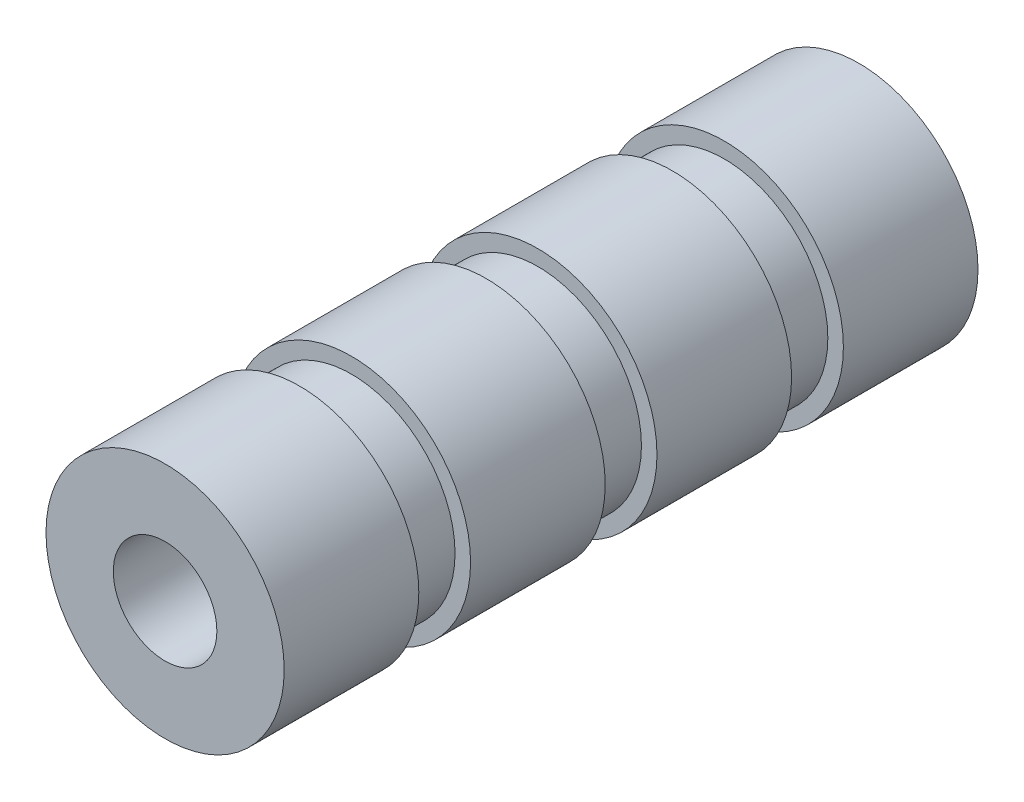
ISO-10303-21;
HEADER;
FILE_DESCRIPTION(('STEP AP214'),'2;1');
FILE_NAME('part.step','',(''),(''),'','','');
FILE_SCHEMA(('AUTOMOTIVE_DESIGN { 1 0 10303 214 1 1 1 1 }'));
ENDSEC;
DATA;
#1=APPLICATION_CONTEXT('core data for automotive mechanical design processes');
#2=APPLICATION_PROTOCOL_DEFINITION('international standard','automotive_design',2000,#1);
#3=PRODUCT_CONTEXT('',#1,'mechanical');
#4=PRODUCT('Part','Part','',(#3));
#5=PRODUCT_RELATED_PRODUCT_CATEGORY('part','',(#4));
#6=PRODUCT_DEFINITION_FORMATION('','',#4);
#7=PRODUCT_DEFINITION_CONTEXT('part definition',#1,'design');
#8=PRODUCT_DEFINITION('design','',#6,#7);
#9=PRODUCT_DEFINITION_SHAPE('','',#8);
#10=(LENGTH_UNIT() NAMED_UNIT(*) SI_UNIT(.MILLI.,.METRE.));
#11=(NAMED_UNIT(*) PLANE_ANGLE_UNIT() SI_UNIT($,.RADIAN.));
#12=(NAMED_UNIT(*) SI_UNIT($,.STERADIAN.) SOLID_ANGLE_UNIT());
#13=UNCERTAINTY_MEASURE_WITH_UNIT(LENGTH_MEASURE(1.E-05),#10,'distance_accuracy_value','');
#14=(GEOMETRIC_REPRESENTATION_CONTEXT(3) GLOBAL_UNCERTAINTY_ASSIGNED_CONTEXT((#13)) GLOBAL_UNIT_ASSIGNED_CONTEXT((#10,
#11,#12)) REPRESENTATION_CONTEXT('',''));
#15=CARTESIAN_POINT('',(0.,0.,0.));
#16=DIRECTION('',(0.,0.,1.));
#17=DIRECTION('',(1.,0.,0.));
#18=AXIS2_PLACEMENT_3D('',#15,#16,#17);
#19=CARTESIAN_POINT('',(0.,0.,13.));
#20=DIRECTION('',(0.,0.,-1.));
#21=DIRECTION('',(-1.,0.,0.));
#22=AXIS2_PLACEMENT_3D('',#19,#20,#21);
#23=CYLINDRICAL_SURFACE('',#22,11.5);
#24=CARTESIAN_POINT('',(0.,0.,13.));
#25=DIRECTION('',(0.,0.,1.));
#26=DIRECTION('',(1.,0.,0.));
#27=AXIS2_PLACEMENT_3D('',#24,#25,#26);
#28=CIRCLE('',#27,11.5);
#29=CARTESIAN_POINT('',(11.5,0.,13.));
#30=VERTEX_POINT('',#29);
#31=EDGE_CURVE('E89',#30,#30,#28,.T.);
#32=ORIENTED_EDGE('',*,*,#31,.F.);
#33=EDGE_LOOP('',(#32));
#34=FACE_BOUND('',#33,.T.);
#35=CARTESIAN_POINT('',(0.,0.,0.));
#36=DIRECTION('',(0.,0.,1.));
#37=DIRECTION('',(1.,0.,0.));
#38=AXIS2_PLACEMENT_3D('',#35,#36,#37);
#39=CIRCLE('',#38,11.5);
#40=CARTESIAN_POINT('',(11.5,0.,0.));
#41=VERTEX_POINT('',#40);
#42=EDGE_CURVE('E46',#41,#41,#39,.T.);
#43=ORIENTED_EDGE('',*,*,#42,.T.);
#44=EDGE_LOOP('',(#43));
#45=FACE_BOUND('',#44,.T.);
#46=ADVANCED_FACE('F43',(#34,#45),#23,.T.);
#47=CARTESIAN_POINT('',(0.,0.,13.));
#48=DIRECTION('',(0.,0.,1.));
#49=DIRECTION('',(1.,0.,0.));
#50=AXIS2_PLACEMENT_3D('',#47,#48,#49);
#51=PLANE('',#50);
#52=CARTESIAN_POINT('',(0.,0.,13.));
#53=DIRECTION('',(0.,0.,1.));
#54=DIRECTION('',(1.,0.,0.));
#55=AXIS2_PLACEMENT_3D('',#52,#53,#54);
#56=CIRCLE('',#55,10.);
#57=CARTESIAN_POINT('',(10.,0.,13.));
#58=VERTEX_POINT('',#57);
#59=EDGE_CURVE('E57',#58,#58,#56,.T.);
#60=ORIENTED_EDGE('',*,*,#59,.F.);
#61=EDGE_LOOP('',(#60));
#62=FACE_BOUND('',#61,.T.);
#63=ORIENTED_EDGE('',*,*,#31,.T.);
#64=EDGE_LOOP('',(#63));
#65=FACE_BOUND('',#64,.T.);
#66=ADVANCED_FACE('F102',(#62,#65),#51,.T.);
#67=CARTESIAN_POINT('',(0.,0.,0.));
#68=DIRECTION('',(0.,0.,1.));
#69=DIRECTION('',(1.,0.,0.));
#70=AXIS2_PLACEMENT_3D('',#67,#68,#69);
#71=PLANE('',#70);
#72=CARTESIAN_POINT('',(0.,0.,0.));
#73=DIRECTION('',(0.,0.,1.));
#74=DIRECTION('',(1.,0.,0.));
#75=AXIS2_PLACEMENT_3D('',#72,#73,#74);
#76=CIRCLE('',#75,5.);
#77=CARTESIAN_POINT('',(5.,0.,0.));
#78=VERTEX_POINT('',#77);
#79=EDGE_CURVE('E293',#78,#78,#76,.T.);
#80=ORIENTED_EDGE('',*,*,#79,.T.);
#81=EDGE_LOOP('',(#80));
#82=FACE_BOUND('',#81,.T.);
#83=ORIENTED_EDGE('',*,*,#42,.F.);
#84=EDGE_LOOP('',(#83));
#85=FACE_BOUND('',#84,.T.);
#86=ADVANCED_FACE('F99',(#82,#85),#71,.F.);
#87=CARTESIAN_POINT('',(0.,0.,18.));
#88=DIRECTION('',(0.,0.,-1.));
#89=DIRECTION('',(-1.,0.,0.));
#90=AXIS2_PLACEMENT_3D('',#87,#88,#89);
#91=CYLINDRICAL_SURFACE('',#90,10.);
#92=CARTESIAN_POINT('',(0.,0.,18.));
#93=DIRECTION('',(0.,0.,1.));
#94=DIRECTION('',(1.,0.,0.));
#95=AXIS2_PLACEMENT_3D('',#92,#93,#94);
#96=CIRCLE('',#95,10.);
#97=CARTESIAN_POINT('',(10.,0.,18.));
#98=VERTEX_POINT('',#97);
#99=EDGE_CURVE('E80',#98,#98,#96,.T.);
#100=ORIENTED_EDGE('',*,*,#99,.F.);
#101=EDGE_LOOP('',(#100));
#102=FACE_BOUND('',#101,.T.);
#103=ORIENTED_EDGE('',*,*,#59,.T.);
#104=EDGE_LOOP('',(#103));
#105=FACE_BOUND('',#104,.T.);
#106=ADVANCED_FACE('F101',(#102,#105),#91,.T.);
#107=CARTESIAN_POINT('',(0.,0.,31.));
#108=DIRECTION('',(0.,0.,-1.));
#109=DIRECTION('',(-1.,0.,0.));
#110=AXIS2_PLACEMENT_3D('',#107,#108,#109);
#111=CYLINDRICAL_SURFACE('',#110,11.5);
#112=CARTESIAN_POINT('',(0.,0.,31.));
#113=DIRECTION('',(0.,0.,1.));
#114=DIRECTION('',(1.,0.,0.));
#115=AXIS2_PLACEMENT_3D('',#112,#113,#114);
#116=CIRCLE('',#115,11.5);
#117=CARTESIAN_POINT('',(11.5,0.,31.));
#118=VERTEX_POINT('',#117);
#119=EDGE_CURVE('E76',#118,#118,#116,.T.);
#120=ORIENTED_EDGE('',*,*,#119,.F.);
#121=EDGE_LOOP('',(#120));
#122=FACE_BOUND('',#121,.T.);
#123=CARTESIAN_POINT('',(0.,0.,18.));
#124=DIRECTION('',(0.,0.,1.));
#125=DIRECTION('',(1.,0.,0.));
#126=AXIS2_PLACEMENT_3D('',#123,#124,#125);
#127=CIRCLE('',#126,11.5);
#128=CARTESIAN_POINT('',(11.5,0.,18.));
#129=VERTEX_POINT('',#128);
#130=EDGE_CURVE('E74',#129,#129,#127,.T.);
#131=ORIENTED_EDGE('',*,*,#130,.T.);
#132=EDGE_LOOP('',(#131));
#133=FACE_BOUND('',#132,.T.);
#134=ADVANCED_FACE('F108',(#122,#133),#111,.T.);
#135=CARTESIAN_POINT('',(0.,0.,31.));
#136=DIRECTION('',(0.,0.,1.));
#137=DIRECTION('',(1.,0.,0.));
#138=AXIS2_PLACEMENT_3D('',#135,#136,#137);
#139=PLANE('',#138);
#140=CARTESIAN_POINT('',(0.,0.,31.));
#141=DIRECTION('',(0.,0.,1.));
#142=DIRECTION('',(1.,0.,0.));
#143=AXIS2_PLACEMENT_3D('',#140,#141,#142);
#144=CIRCLE('',#143,10.);
#145=CARTESIAN_POINT('',(10.,0.,31.));
#146=VERTEX_POINT('',#145);
#147=EDGE_CURVE('E51',#146,#146,#144,.T.);
#148=ORIENTED_EDGE('',*,*,#147,.F.);
#149=EDGE_LOOP('',(#148));
#150=FACE_BOUND('',#149,.T.);
#151=ORIENTED_EDGE('',*,*,#119,.T.);
#152=EDGE_LOOP('',(#151));
#153=FACE_BOUND('',#152,.T.);
#154=ADVANCED_FACE('F140',(#150,#153),#139,.T.);
#155=CARTESIAN_POINT('',(0.,0.,18.));
#156=DIRECTION('',(0.,0.,1.));
#157=DIRECTION('',(1.,0.,0.));
#158=AXIS2_PLACEMENT_3D('',#155,#156,#157);
#159=PLANE('',#158);
#160=ORIENTED_EDGE('',*,*,#99,.T.);
#161=EDGE_LOOP('',(#160));
#162=FACE_BOUND('',#161,.T.);
#163=ORIENTED_EDGE('',*,*,#130,.F.);
#164=EDGE_LOOP('',(#163));
#165=FACE_BOUND('',#164,.T.);
#166=ADVANCED_FACE('F149',(#162,#165),#159,.F.);
#167=CARTESIAN_POINT('',(0.,0.,36.));
#168=DIRECTION('',(0.,0.,-1.));
#169=DIRECTION('',(-1.,0.,0.));
#170=AXIS2_PLACEMENT_3D('',#167,#168,#169);
#171=CYLINDRICAL_SURFACE('',#170,10.);
#172=CARTESIAN_POINT('',(0.,0.,36.));
#173=DIRECTION('',(0.,0.,1.));
#174=DIRECTION('',(1.,0.,0.));
#175=AXIS2_PLACEMENT_3D('',#172,#173,#174);
#176=CIRCLE('',#175,10.);
#177=CARTESIAN_POINT('',(10.,0.,36.));
#178=VERTEX_POINT('',#177);
#179=EDGE_CURVE('E67',#178,#178,#176,.T.);
#180=ORIENTED_EDGE('',*,*,#179,.F.);
#181=EDGE_LOOP('',(#180));
#182=FACE_BOUND('',#181,.T.);
#183=ORIENTED_EDGE('',*,*,#147,.T.);
#184=EDGE_LOOP('',(#183));
#185=FACE_BOUND('',#184,.T.);
#186=ADVANCED_FACE('F154',(#182,#185),#171,.T.);
#187=CARTESIAN_POINT('',(0.,0.,49.));
#188=DIRECTION('',(0.,0.,-1.));
#189=DIRECTION('',(-1.,0.,0.));
#190=AXIS2_PLACEMENT_3D('',#187,#188,#189);
#191=CYLINDRICAL_SURFACE('',#190,11.5);
#192=CARTESIAN_POINT('',(0.,0.,49.));
#193=DIRECTION('',(0.,0.,1.));
#194=DIRECTION('',(1.,0.,0.));
#195=AXIS2_PLACEMENT_3D('',#192,#193,#194);
#196=CIRCLE('',#195,11.5);
#197=CARTESIAN_POINT('',(11.5,0.,49.));
#198=VERTEX_POINT('',#197);
#199=EDGE_CURVE('E63',#198,#198,#196,.T.);
#200=ORIENTED_EDGE('',*,*,#199,.F.);
#201=EDGE_LOOP('',(#200));
#202=FACE_BOUND('',#201,.T.);
#203=CARTESIAN_POINT('',(0.,0.,36.));
#204=DIRECTION('',(0.,0.,1.));
#205=DIRECTION('',(1.,0.,0.));
#206=AXIS2_PLACEMENT_3D('',#203,#204,#205);
#207=CIRCLE('',#206,11.5);
#208=CARTESIAN_POINT('',(11.5,0.,36.));
#209=VERTEX_POINT('',#208);
#210=EDGE_CURVE('E68',#209,#209,#207,.T.);
#211=ORIENTED_EDGE('',*,*,#210,.T.);
#212=EDGE_LOOP('',(#211));
#213=FACE_BOUND('',#212,.T.);
#214=ADVANCED_FACE('F173',(#202,#213),#191,.T.);
#215=CARTESIAN_POINT('',(0.,0.,49.));
#216=DIRECTION('',(0.,0.,1.));
#217=DIRECTION('',(1.,0.,0.));
#218=AXIS2_PLACEMENT_3D('',#215,#216,#217);
#219=PLANE('',#218);
#220=CARTESIAN_POINT('',(0.,0.,49.));
#221=DIRECTION('',(0.,0.,1.));
#222=DIRECTION('',(1.,0.,0.));
#223=AXIS2_PLACEMENT_3D('',#220,#221,#222);
#224=CIRCLE('',#223,10.);
#225=CARTESIAN_POINT('',(10.,0.,49.));
#226=VERTEX_POINT('',#225);
#227=EDGE_CURVE('E10',#226,#226,#224,.T.);
#228=ORIENTED_EDGE('',*,*,#227,.F.);
#229=EDGE_LOOP('',(#228));
#230=FACE_BOUND('',#229,.T.);
#231=ORIENTED_EDGE('',*,*,#199,.T.);
#232=EDGE_LOOP('',(#231));
#233=FACE_BOUND('',#232,.T.);
#234=ADVANCED_FACE('F184',(#230,#233),#219,.T.);
#235=CARTESIAN_POINT('',(0.,0.,36.));
#236=DIRECTION('',(0.,0.,1.));
#237=DIRECTION('',(1.,0.,0.));
#238=AXIS2_PLACEMENT_3D('',#235,#236,#237);
#239=PLANE('',#238);
#240=ORIENTED_EDGE('',*,*,#179,.T.);
#241=EDGE_LOOP('',(#240));
#242=FACE_BOUND('',#241,.T.);
#243=ORIENTED_EDGE('',*,*,#210,.F.);
#244=EDGE_LOOP('',(#243));
#245=FACE_BOUND('',#244,.T.);
#246=ADVANCED_FACE('F193',(#242,#245),#239,.F.);
#247=CARTESIAN_POINT('',(0.,0.,54.));
#248=DIRECTION('',(0.,0.,-1.));
#249=DIRECTION('',(-1.,0.,0.));
#250=AXIS2_PLACEMENT_3D('',#247,#248,#249);
#251=CYLINDRICAL_SURFACE('',#250,10.);
#252=CARTESIAN_POINT('',(0.,0.,54.));
#253=DIRECTION('',(0.,0.,1.));
#254=DIRECTION('',(1.,0.,0.));
#255=AXIS2_PLACEMENT_3D('',#252,#253,#254);
#256=CIRCLE('',#255,10.);
#257=CARTESIAN_POINT('',(10.,0.,54.));
#258=VERTEX_POINT('',#257);
#259=EDGE_CURVE('E61',#258,#258,#256,.T.);
#260=ORIENTED_EDGE('',*,*,#259,.F.);
#261=EDGE_LOOP('',(#260));
#262=FACE_BOUND('',#261,.T.);
#263=ORIENTED_EDGE('',*,*,#227,.T.);
#264=EDGE_LOOP('',(#263));
#265=FACE_BOUND('',#264,.T.);
#266=ADVANCED_FACE('F198',(#262,#265),#251,.T.);
#267=CARTESIAN_POINT('',(0.,0.,67.));
#268=DIRECTION('',(0.,0.,-1.));
#269=DIRECTION('',(-1.,0.,0.));
#270=AXIS2_PLACEMENT_3D('',#267,#268,#269);
#271=CYLINDRICAL_SURFACE('',#270,11.5);
#272=CARTESIAN_POINT('',(0.,0.,67.));
#273=DIRECTION('',(0.,0.,1.));
#274=DIRECTION('',(1.,0.,0.));
#275=AXIS2_PLACEMENT_3D('',#272,#273,#274);
#276=CIRCLE('',#275,11.5);
#277=CARTESIAN_POINT('',(11.5,0.,67.));
#278=VERTEX_POINT('',#277);
#279=EDGE_CURVE('E303',#278,#278,#276,.T.);
#280=ORIENTED_EDGE('',*,*,#279,.F.);
#281=EDGE_LOOP('',(#280));
#282=FACE_BOUND('',#281,.T.);
#283=CARTESIAN_POINT('',(0.,0.,54.));
#284=DIRECTION('',(0.,0.,1.));
#285=DIRECTION('',(1.,0.,0.));
#286=AXIS2_PLACEMENT_3D('',#283,#284,#285);
#287=CIRCLE('',#286,11.5);
#288=CARTESIAN_POINT('',(11.5,0.,54.));
#289=VERTEX_POINT('',#288);
#290=EDGE_CURVE('E300',#289,#289,#287,.T.);
#291=ORIENTED_EDGE('',*,*,#290,.T.);
#292=EDGE_LOOP('',(#291));
#293=FACE_BOUND('',#292,.T.);
#294=ADVANCED_FACE('F217',(#282,#293),#271,.T.);
#295=CARTESIAN_POINT('',(0.,0.,67.));
#296=DIRECTION('',(0.,0.,1.));
#297=DIRECTION('',(1.,0.,0.));
#298=AXIS2_PLACEMENT_3D('',#295,#296,#297);
#299=PLANE('',#298);
#300=CARTESIAN_POINT('',(0.,0.,67.));
#301=DIRECTION('',(0.,0.,1.));
#302=DIRECTION('',(1.,0.,0.));
#303=AXIS2_PLACEMENT_3D('',#300,#301,#302);
#304=CIRCLE('',#303,5.);
#305=CARTESIAN_POINT('',(5.,0.,67.));
#306=VERTEX_POINT('',#305);
#307=EDGE_CURVE('E296',#306,#306,#304,.T.);
#308=ORIENTED_EDGE('',*,*,#307,.F.);
#309=EDGE_LOOP('',(#308));
#310=FACE_BOUND('',#309,.T.);
#311=ORIENTED_EDGE('',*,*,#279,.T.);
#312=EDGE_LOOP('',(#311));
#313=FACE_BOUND('',#312,.T.);
#314=ADVANCED_FACE('F228',(#310,#313),#299,.T.);
#315=CARTESIAN_POINT('',(0.,0.,54.));
#316=DIRECTION('',(0.,0.,1.));
#317=DIRECTION('',(1.,0.,0.));
#318=AXIS2_PLACEMENT_3D('',#315,#316,#317);
#319=PLANE('',#318);
#320=ORIENTED_EDGE('',*,*,#259,.T.);
#321=EDGE_LOOP('',(#320));
#322=FACE_BOUND('',#321,.T.);
#323=ORIENTED_EDGE('',*,*,#290,.F.);
#324=EDGE_LOOP('',(#323));
#325=FACE_BOUND('',#324,.T.);
#326=ADVANCED_FACE('F237',(#322,#325),#319,.F.);
#327=CARTESIAN_POINT('',(0.,0.,0.));
#328=DIRECTION('',(0.,0.,1.));
#329=DIRECTION('',(1.,0.,0.));
#330=AXIS2_PLACEMENT_3D('',#327,#328,#329);
#331=CYLINDRICAL_SURFACE('',#330,5.);
#332=ORIENTED_EDGE('',*,*,#79,.F.);
#333=EDGE_LOOP('',(#332));
#334=FACE_BOUND('',#333,.T.);
#335=ORIENTED_EDGE('',*,*,#307,.T.);
#336=EDGE_LOOP('',(#335));
#337=FACE_BOUND('',#336,.T.);
#338=ADVANCED_FACE('F241',(#334,#337),#331,.F.);
#339=CLOSED_SHELL('',(#46,#66,#86,#106,#134,#154,#166,#186,#214,#234,#246,#266,#294,#314,#326,#338));
#340=MANIFOLD_SOLID_BREP('B2',#339);
#341=ADVANCED_BREP_SHAPE_REPRESENTATION('',(#18,#340),#14);
#342=SHAPE_DEFINITION_REPRESENTATION(#9,#341);
ENDSEC;
END-ISO-10303-21;
